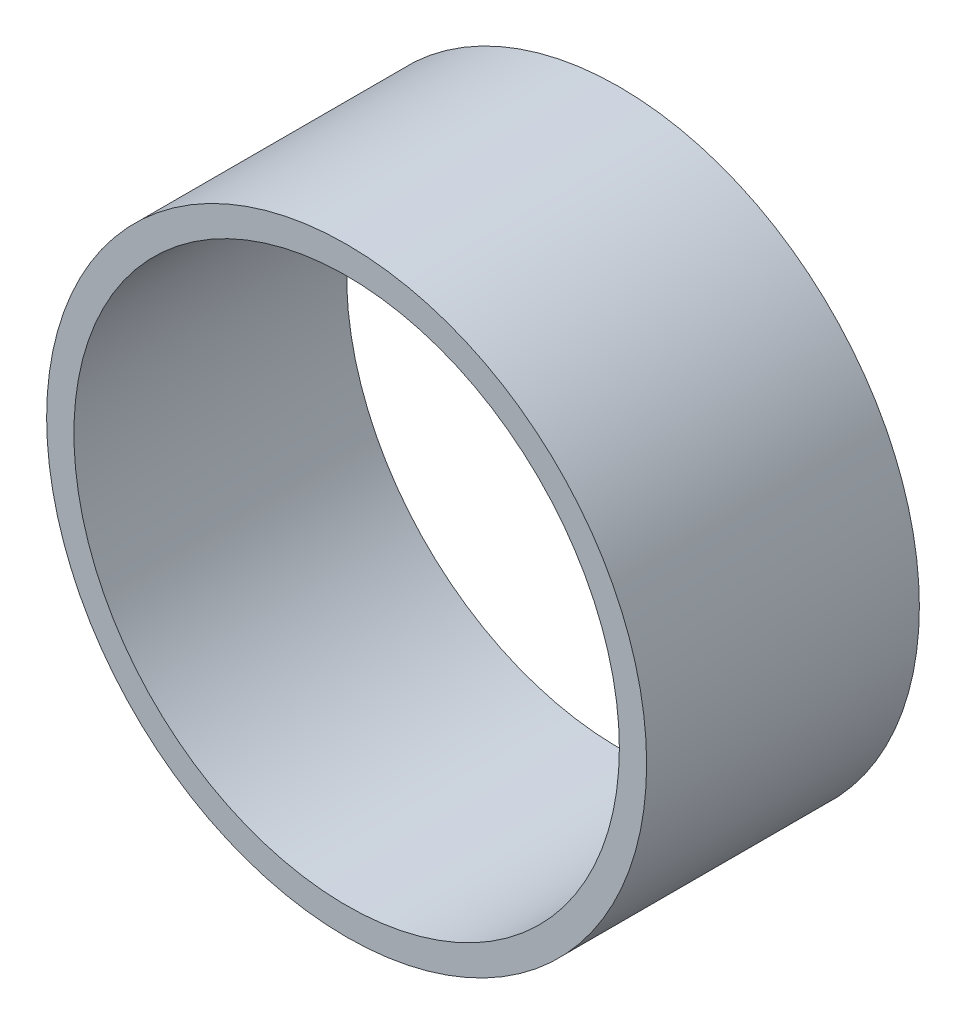
ISO-10303-21;
HEADER;
FILE_DESCRIPTION(('STEP AP214'),'2;1');
FILE_NAME('part.step','',(''),(''),'','','');
FILE_SCHEMA(('AUTOMOTIVE_DESIGN { 1 0 10303 214 1 1 1 1 }'));
ENDSEC;
DATA;
#1=APPLICATION_CONTEXT('core data for automotive mechanical design processes');
#2=APPLICATION_PROTOCOL_DEFINITION('international standard','automotive_design',2000,#1);
#3=PRODUCT_CONTEXT('',#1,'mechanical');
#4=PRODUCT('Part','Part','',(#3));
#5=PRODUCT_RELATED_PRODUCT_CATEGORY('part','',(#4));
#6=PRODUCT_DEFINITION_FORMATION('','',#4);
#7=PRODUCT_DEFINITION_CONTEXT('part definition',#1,'design');
#8=PRODUCT_DEFINITION('design','',#6,#7);
#9=PRODUCT_DEFINITION_SHAPE('','',#8);
#10=(LENGTH_UNIT() NAMED_UNIT(*) SI_UNIT(.MILLI.,.METRE.));
#11=(NAMED_UNIT(*) PLANE_ANGLE_UNIT() SI_UNIT($,.RADIAN.));
#12=(NAMED_UNIT(*) SI_UNIT($,.STERADIAN.) SOLID_ANGLE_UNIT());
#13=UNCERTAINTY_MEASURE_WITH_UNIT(LENGTH_MEASURE(1.E-05),#10,'distance_accuracy_value','');
#14=(GEOMETRIC_REPRESENTATION_CONTEXT(3) GLOBAL_UNCERTAINTY_ASSIGNED_CONTEXT((#13)) GLOBAL_UNIT_ASSIGNED_CONTEXT((#10,
#11,#12)) REPRESENTATION_CONTEXT('',''));
#15=CARTESIAN_POINT('',(0.,0.,0.));
#16=DIRECTION('',(0.,0.,1.));
#17=DIRECTION('',(1.,0.,0.));
#18=AXIS2_PLACEMENT_3D('',#15,#16,#17);
#19=CARTESIAN_POINT('',(0.,0.,5.));
#20=DIRECTION('',(0.,0.,1.));
#21=DIRECTION('',(1.,0.,0.));
#22=AXIS2_PLACEMENT_3D('',#19,#20,#21);
#23=PLANE('',#22);
#24=CARTESIAN_POINT('',(0.,0.,5.));
#25=DIRECTION('',(0.,0.,1.));
#26=DIRECTION('',(1.,0.,0.));
#27=AXIS2_PLACEMENT_3D('',#24,#25,#26);
#28=CIRCLE('',#27,5.5);
#29=CARTESIAN_POINT('',(5.5,0.,5.));
#30=VERTEX_POINT('',#29);
#31=EDGE_CURVE('E10',#30,#30,#28,.T.);
#32=ORIENTED_EDGE('',*,*,#31,.T.);
#33=EDGE_LOOP('',(#32));
#34=FACE_BOUND('',#33,.T.);
#35=CARTESIAN_POINT('',(0.,0.,5.));
#36=DIRECTION('',(0.,0.,1.));
#37=DIRECTION('',(1.,0.,0.));
#38=AXIS2_PLACEMENT_3D('',#35,#36,#37);
#39=CIRCLE('',#38,5.);
#40=CARTESIAN_POINT('',(5.,0.,5.));
#41=VERTEX_POINT('',#40);
#42=EDGE_CURVE('E42',#41,#41,#39,.T.);
#43=ORIENTED_EDGE('',*,*,#42,.F.);
#44=EDGE_LOOP('',(#43));
#45=FACE_BOUND('',#44,.T.);
#46=ADVANCED_FACE('F31',(#34,#45),#23,.T.);
#47=CARTESIAN_POINT('',(0.,0.,0.));
#48=DIRECTION('',(0.,0.,1.));
#49=DIRECTION('',(1.,0.,0.));
#50=AXIS2_PLACEMENT_3D('',#47,#48,#49);
#51=PLANE('',#50);
#52=CARTESIAN_POINT('',(0.,0.,0.));
#53=DIRECTION('',(0.,0.,1.));
#54=DIRECTION('',(1.,0.,0.));
#55=AXIS2_PLACEMENT_3D('',#52,#53,#54);
#56=CIRCLE('',#55,5.5);
#57=CARTESIAN_POINT('',(5.5,0.,0.));
#58=VERTEX_POINT('',#57);
#59=EDGE_CURVE('E35',#58,#58,#56,.T.);
#60=ORIENTED_EDGE('',*,*,#59,.F.);
#61=EDGE_LOOP('',(#60));
#62=FACE_BOUND('',#61,.T.);
#63=CARTESIAN_POINT('',(0.,0.,0.));
#64=DIRECTION('',(0.,0.,1.));
#65=DIRECTION('',(1.,0.,0.));
#66=AXIS2_PLACEMENT_3D('',#63,#64,#65);
#67=CIRCLE('',#66,5.);
#68=CARTESIAN_POINT('',(5.,0.,0.));
#69=VERTEX_POINT('',#68);
#70=EDGE_CURVE('E44',#69,#69,#67,.T.);
#71=ORIENTED_EDGE('',*,*,#70,.T.);
#72=EDGE_LOOP('',(#71));
#73=FACE_BOUND('',#72,.T.);
#74=ADVANCED_FACE('F54',(#62,#73),#51,.F.);
#75=CARTESIAN_POINT('',(0.,0.,5.));
#76=DIRECTION('',(0.,0.,-1.));
#77=DIRECTION('',(-1.,0.,0.));
#78=AXIS2_PLACEMENT_3D('',#75,#76,#77);
#79=CYLINDRICAL_SURFACE('',#78,5.5);
#80=ORIENTED_EDGE('',*,*,#31,.F.);
#81=EDGE_LOOP('',(#80));
#82=FACE_BOUND('',#81,.T.);
#83=ORIENTED_EDGE('',*,*,#59,.T.);
#84=EDGE_LOOP('',(#83));
#85=FACE_BOUND('',#84,.T.);
#86=ADVANCED_FACE('F33',(#82,#85),#79,.T.);
#87=CARTESIAN_POINT('',(0.,0.,5.));
#88=DIRECTION('',(0.,0.,-1.));
#89=DIRECTION('',(-1.,0.,0.));
#90=AXIS2_PLACEMENT_3D('',#87,#88,#89);
#91=CYLINDRICAL_SURFACE('',#90,5.);
#92=ORIENTED_EDGE('',*,*,#42,.T.);
#93=EDGE_LOOP('',(#92));
#94=FACE_BOUND('',#93,.T.);
#95=ORIENTED_EDGE('',*,*,#70,.F.);
#96=EDGE_LOOP('',(#95));
#97=FACE_BOUND('',#96,.T.);
#98=ADVANCED_FACE('F50',(#94,#97),#91,.F.);
#99=CLOSED_SHELL('',(#46,#74,#86,#98));
#100=MANIFOLD_SOLID_BREP('B2',#99);
#101=ADVANCED_BREP_SHAPE_REPRESENTATION('',(#18,#100),#14);
#102=SHAPE_DEFINITION_REPRESENTATION(#9,#101);
ENDSEC;
END-ISO-10303-21;
